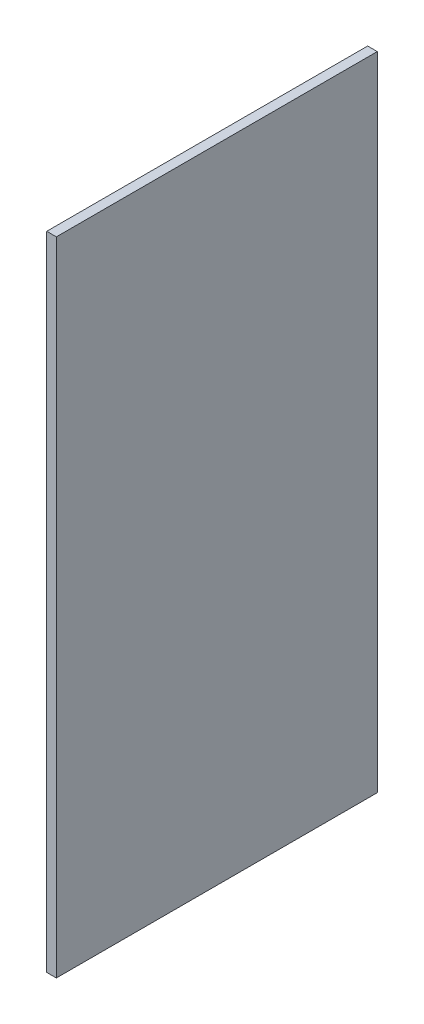
ISO-10303-21;
HEADER;
FILE_DESCRIPTION(('STEP AP214'),'2;1');
FILE_NAME('part.step','',(''),(''),'','','');
FILE_SCHEMA(('AUTOMOTIVE_DESIGN { 1 0 10303 214 1 1 1 1 }'));
ENDSEC;
DATA;
#1=APPLICATION_CONTEXT('core data for automotive mechanical design processes');
#2=APPLICATION_PROTOCOL_DEFINITION('international standard','automotive_design',2000,#1);
#3=PRODUCT_CONTEXT('',#1,'mechanical');
#4=PRODUCT('Part','Part','',(#3));
#5=PRODUCT_RELATED_PRODUCT_CATEGORY('part','',(#4));
#6=PRODUCT_DEFINITION_FORMATION('','',#4);
#7=PRODUCT_DEFINITION_CONTEXT('part definition',#1,'design');
#8=PRODUCT_DEFINITION('design','',#6,#7);
#9=PRODUCT_DEFINITION_SHAPE('','',#8);
#10=(LENGTH_UNIT() NAMED_UNIT(*) SI_UNIT(.MILLI.,.METRE.));
#11=(NAMED_UNIT(*) PLANE_ANGLE_UNIT() SI_UNIT($,.RADIAN.));
#12=(NAMED_UNIT(*) SI_UNIT($,.STERADIAN.) SOLID_ANGLE_UNIT());
#13=UNCERTAINTY_MEASURE_WITH_UNIT(LENGTH_MEASURE(1.E-05),#10,'distance_accuracy_value','');
#14=(GEOMETRIC_REPRESENTATION_CONTEXT(3) GLOBAL_UNCERTAINTY_ASSIGNED_CONTEXT((#13)) GLOBAL_UNIT_ASSIGNED_CONTEXT((#10,
#11,#12)) REPRESENTATION_CONTEXT('',''));
#15=CARTESIAN_POINT('',(0.,0.,0.));
#16=DIRECTION('',(0.,0.,1.));
#17=DIRECTION('',(1.,0.,0.));
#18=AXIS2_PLACEMENT_3D('',#15,#16,#17);
#19=CARTESIAN_POINT('',(48.5,0.,50.));
#20=DIRECTION('',(0.,1.,0.));
#21=DIRECTION('',(1.,0.,0.));
#22=AXIS2_PLACEMENT_3D('',#19,#20,#21);
#23=PLANE('',#22);
#24=DIRECTION('',(-1.,0.,0.));
#25=VECTOR('',#24,1.);
#26=CARTESIAN_POINT('',(3.,0.,0.));
#27=LINE('',#26,#25);
#28=CARTESIAN_POINT('',(3.,0.,0.));
#29=VERTEX_POINT('',#28);
#30=CARTESIAN_POINT('',(0.,0.,0.));
#31=VERTEX_POINT('',#30);
#32=EDGE_CURVE('E28',#29,#31,#27,.T.);
#33=ORIENTED_EDGE('',*,*,#32,.F.);
#34=DIRECTION('',(0.,0.,-1.));
#35=VECTOR('',#34,1.);
#36=CARTESIAN_POINT('',(3.,0.,100.));
#37=LINE('',#36,#35);
#38=CARTESIAN_POINT('',(3.,0.,100.));
#39=VERTEX_POINT('',#38);
#40=EDGE_CURVE('E97',#39,#29,#37,.T.);
#41=ORIENTED_EDGE('',*,*,#40,.F.);
#42=DIRECTION('',(1.,0.,0.));
#43=VECTOR('',#42,1.);
#44=CARTESIAN_POINT('',(0.,0.,100.));
#45=LINE('',#44,#43);
#46=CARTESIAN_POINT('',(0.,0.,100.));
#47=VERTEX_POINT('',#46);
#48=EDGE_CURVE('E88',#47,#39,#45,.T.);
#49=ORIENTED_EDGE('',*,*,#48,.F.);
#50=DIRECTION('',(0.,0.,1.));
#51=VECTOR('',#50,1.);
#52=CARTESIAN_POINT('',(0.,0.,0.));
#53=LINE('',#52,#51);
#54=EDGE_CURVE('E74',#31,#47,#53,.T.);
#55=ORIENTED_EDGE('',*,*,#54,.F.);
#56=EDGE_LOOP('',(#33,#41,#49,#55));
#57=FACE_BOUND('',#56,.T.);
#58=ADVANCED_FACE('F17',(#57),#23,.F.);
#59=CARTESIAN_POINT('',(48.5,200.,50.));
#60=DIRECTION('',(0.,1.,0.));
#61=DIRECTION('',(1.,0.,0.));
#62=AXIS2_PLACEMENT_3D('',#59,#60,#61);
#63=PLANE('',#62);
#64=DIRECTION('',(-1.,0.,0.));
#65=VECTOR('',#64,1.);
#66=CARTESIAN_POINT('',(3.,200.,0.));
#67=LINE('',#66,#65);
#68=CARTESIAN_POINT('',(3.,200.,0.));
#69=VERTEX_POINT('',#68);
#70=CARTESIAN_POINT('',(0.,200.,0.));
#71=VERTEX_POINT('',#70);
#72=EDGE_CURVE('E11',#69,#71,#67,.T.);
#73=ORIENTED_EDGE('',*,*,#72,.T.);
#74=DIRECTION('',(0.,0.,1.));
#75=VECTOR('',#74,1.);
#76=CARTESIAN_POINT('',(0.,200.,0.));
#77=LINE('',#76,#75);
#78=CARTESIAN_POINT('',(0.,200.,100.));
#79=VERTEX_POINT('',#78);
#80=EDGE_CURVE('E64',#71,#79,#77,.T.);
#81=ORIENTED_EDGE('',*,*,#80,.T.);
#82=DIRECTION('',(1.,0.,0.));
#83=VECTOR('',#82,1.);
#84=CARTESIAN_POINT('',(0.,200.,100.));
#85=LINE('',#84,#83);
#86=CARTESIAN_POINT('',(3.,200.,100.));
#87=VERTEX_POINT('',#86);
#88=EDGE_CURVE('E68',#79,#87,#85,.T.);
#89=ORIENTED_EDGE('',*,*,#88,.T.);
#90=DIRECTION('',(0.,0.,-1.));
#91=VECTOR('',#90,1.);
#92=CARTESIAN_POINT('',(3.,200.,100.));
#93=LINE('',#92,#91);
#94=EDGE_CURVE('E103',#87,#69,#93,.T.);
#95=ORIENTED_EDGE('',*,*,#94,.T.);
#96=EDGE_LOOP('',(#73,#81,#89,#95));
#97=FACE_BOUND('',#96,.T.);
#98=ADVANCED_FACE('F66',(#97),#63,.T.);
#99=CARTESIAN_POINT('',(3.,0.,0.));
#100=DIRECTION('',(0.,0.,-1.));
#101=DIRECTION('',(0.,-1.,0.));
#102=AXIS2_PLACEMENT_3D('',#99,#100,#101);
#103=PLANE('',#102);
#104=ORIENTED_EDGE('',*,*,#32,.T.);
#105=DIRECTION('',(0.,1.,0.));
#106=VECTOR('',#105,1.);
#107=CARTESIAN_POINT('',(0.,0.,0.));
#108=LINE('',#107,#106);
#109=EDGE_CURVE('E73',#31,#71,#108,.T.);
#110=ORIENTED_EDGE('',*,*,#109,.T.);
#111=ORIENTED_EDGE('',*,*,#72,.F.);
#112=DIRECTION('',(0.,1.,0.));
#113=VECTOR('',#112,1.);
#114=CARTESIAN_POINT('',(3.,0.,0.));
#115=LINE('',#114,#113);
#116=EDGE_CURVE('E100',#29,#69,#115,.T.);
#117=ORIENTED_EDGE('',*,*,#116,.F.);
#118=EDGE_LOOP('',(#104,#110,#111,#117));
#119=FACE_BOUND('',#118,.T.);
#120=ADVANCED_FACE('F148',(#119),#103,.T.);
#121=CARTESIAN_POINT('',(0.,0.,0.));
#122=DIRECTION('',(-1.,0.,0.));
#123=DIRECTION('',(0.,0.,1.));
#124=AXIS2_PLACEMENT_3D('',#121,#122,#123);
#125=PLANE('',#124);
#126=ORIENTED_EDGE('',*,*,#54,.T.);
#127=DIRECTION('',(0.,1.,0.));
#128=VECTOR('',#127,1.);
#129=CARTESIAN_POINT('',(0.,0.,100.));
#130=LINE('',#129,#128);
#131=EDGE_CURVE('E77',#47,#79,#130,.T.);
#132=ORIENTED_EDGE('',*,*,#131,.T.);
#133=ORIENTED_EDGE('',*,*,#80,.F.);
#134=ORIENTED_EDGE('',*,*,#109,.F.);
#135=EDGE_LOOP('',(#126,#132,#133,#134));
#136=FACE_BOUND('',#135,.T.);
#137=ADVANCED_FACE('F78',(#136),#125,.T.);
#138=CARTESIAN_POINT('',(0.,0.,100.));
#139=DIRECTION('',(0.,0.,1.));
#140=DIRECTION('',(1.,0.,0.));
#141=AXIS2_PLACEMENT_3D('',#138,#139,#140);
#142=PLANE('',#141);
#143=ORIENTED_EDGE('',*,*,#48,.T.);
#144=DIRECTION('',(0.,1.,0.));
#145=VECTOR('',#144,1.);
#146=CARTESIAN_POINT('',(3.,0.,100.));
#147=LINE('',#146,#145);
#148=EDGE_CURVE('E21',#39,#87,#147,.T.);
#149=ORIENTED_EDGE('',*,*,#148,.T.);
#150=ORIENTED_EDGE('',*,*,#88,.F.);
#151=ORIENTED_EDGE('',*,*,#131,.F.);
#152=EDGE_LOOP('',(#143,#149,#150,#151));
#153=FACE_BOUND('',#152,.T.);
#154=ADVANCED_FACE('F84',(#153),#142,.T.);
#155=CARTESIAN_POINT('',(3.,0.,100.));
#156=DIRECTION('',(1.,0.,0.));
#157=DIRECTION('',(0.,0.,-1.));
#158=AXIS2_PLACEMENT_3D('',#155,#156,#157);
#159=PLANE('',#158);
#160=ORIENTED_EDGE('',*,*,#40,.T.);
#161=ORIENTED_EDGE('',*,*,#116,.T.);
#162=ORIENTED_EDGE('',*,*,#94,.F.);
#163=ORIENTED_EDGE('',*,*,#148,.F.);
#164=EDGE_LOOP('',(#160,#161,#162,#163));
#165=FACE_BOUND('',#164,.T.);
#166=ADVANCED_FACE('F19',(#165),#159,.T.);
#167=CLOSED_SHELL('',(#58,#98,#120,#137,#154,#166));
#168=MANIFOLD_SOLID_BREP('B1',#167);
#169=ADVANCED_BREP_SHAPE_REPRESENTATION('',(#18,#168),#14);
#170=SHAPE_DEFINITION_REPRESENTATION(#9,#169);
ENDSEC;
END-ISO-10303-21;
